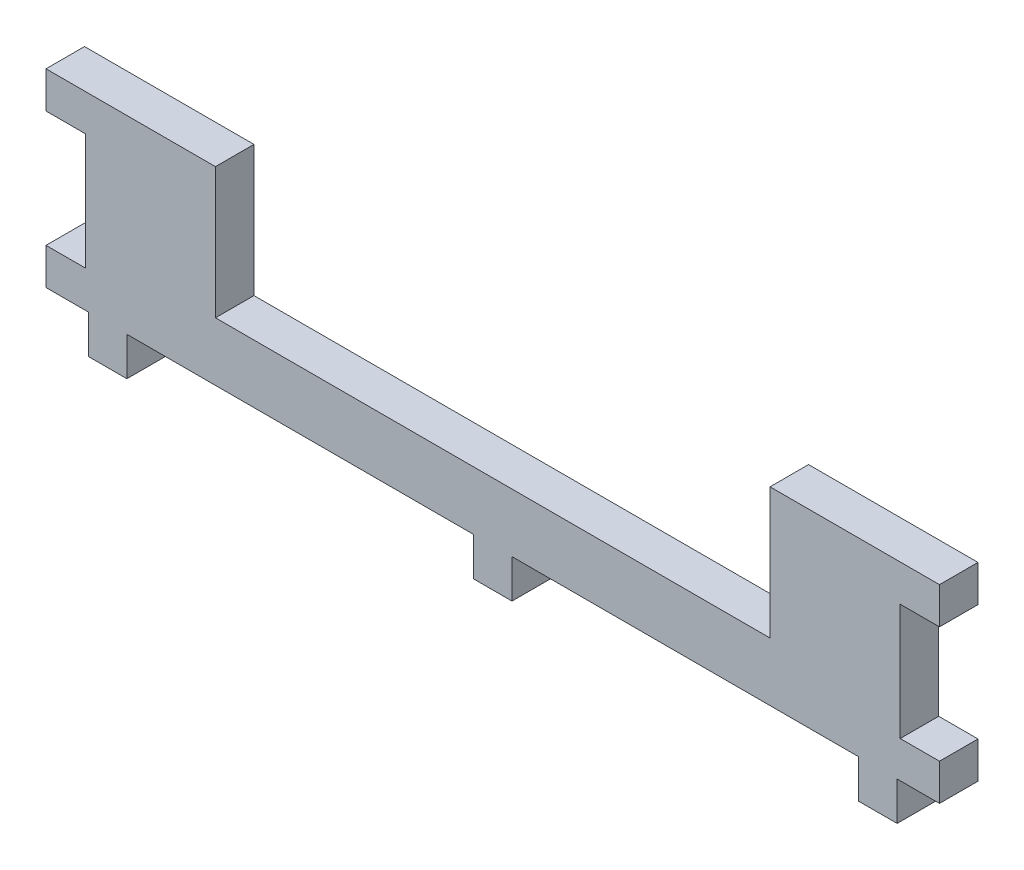
ISO-10303-21;
HEADER;
FILE_DESCRIPTION(('STEP AP214'),'2;1');
FILE_NAME('part.step','',(''),(''),'','','');
FILE_SCHEMA(('AUTOMOTIVE_DESIGN { 1 0 10303 214 1 1 1 1 }'));
ENDSEC;
DATA;
#1=APPLICATION_CONTEXT('core data for automotive mechanical design processes');
#2=APPLICATION_PROTOCOL_DEFINITION('international standard','automotive_design',2000,#1);
#3=PRODUCT_CONTEXT('',#1,'mechanical');
#4=PRODUCT('Part','Part','',(#3));
#5=PRODUCT_RELATED_PRODUCT_CATEGORY('part','',(#4));
#6=PRODUCT_DEFINITION_FORMATION('','',#4);
#7=PRODUCT_DEFINITION_CONTEXT('part definition',#1,'design');
#8=PRODUCT_DEFINITION('design','',#6,#7);
#9=PRODUCT_DEFINITION_SHAPE('','',#8);
#10=(LENGTH_UNIT() NAMED_UNIT(*) SI_UNIT(.MILLI.,.METRE.));
#11=(NAMED_UNIT(*) PLANE_ANGLE_UNIT() SI_UNIT($,.RADIAN.));
#12=(NAMED_UNIT(*) SI_UNIT($,.STERADIAN.) SOLID_ANGLE_UNIT());
#13=UNCERTAINTY_MEASURE_WITH_UNIT(LENGTH_MEASURE(1.E-05),#10,'distance_accuracy_value','');
#14=(GEOMETRIC_REPRESENTATION_CONTEXT(3) GLOBAL_UNCERTAINTY_ASSIGNED_CONTEXT((#13)) GLOBAL_UNIT_ASSIGNED_CONTEXT((#10,
#11,#12)) REPRESENTATION_CONTEXT('',''));
#15=CARTESIAN_POINT('',(0.,0.,0.));
#16=DIRECTION('',(0.,0.,1.));
#17=DIRECTION('',(1.,0.,0.));
#18=AXIS2_PLACEMENT_3D('',#15,#16,#17);
#19=CARTESIAN_POINT('',(58.,-6.15,5.));
#20=DIRECTION('',(-1.,0.,0.));
#21=DIRECTION('',(0.,0.,1.));
#22=AXIS2_PLACEMENT_3D('',#19,#20,#21);
#23=PLANE('',#22);
#24=DIRECTION('',(0.,0.,1.));
#25=VECTOR('',#24,1.);
#26=CARTESIAN_POINT('',(58.,-1.4,0.));
#27=LINE('',#26,#25);
#28=CARTESIAN_POINT('',(58.,-1.4,0.));
#29=VERTEX_POINT('',#28);
#30=CARTESIAN_POINT('',(58.,-1.4,5.));
#31=VERTEX_POINT('',#30);
#32=EDGE_CURVE('E238',#29,#31,#27,.T.);
#33=ORIENTED_EDGE('',*,*,#32,.T.);
#34=DIRECTION('',(0.,1.,0.));
#35=VECTOR('',#34,1.);
#36=CARTESIAN_POINT('',(58.,-6.15,5.));
#37=LINE('',#36,#35);
#38=CARTESIAN_POINT('',(58.,-6.15,5.));
#39=VERTEX_POINT('',#38);
#40=EDGE_CURVE('E401',#39,#31,#37,.T.);
#41=ORIENTED_EDGE('',*,*,#40,.F.);
#42=DIRECTION('',(0.,0.,-1.));
#43=VECTOR('',#42,1.);
#44=CARTESIAN_POINT('',(58.,-6.15,5.));
#45=LINE('',#44,#43);
#46=CARTESIAN_POINT('',(58.,-6.15,0.));
#47=VERTEX_POINT('',#46);
#48=EDGE_CURVE('E42',#39,#47,#45,.T.);
#49=ORIENTED_EDGE('',*,*,#48,.T.);
#50=DIRECTION('',(0.,1.,0.));
#51=VECTOR('',#50,1.);
#52=CARTESIAN_POINT('',(58.,-6.15,0.));
#53=LINE('',#52,#51);
#54=EDGE_CURVE('E436',#47,#29,#53,.T.);
#55=ORIENTED_EDGE('',*,*,#54,.T.);
#56=EDGE_LOOP('',(#33,#41,#49,#55));
#57=FACE_BOUND('',#56,.T.);
#58=ADVANCED_FACE('F33',(#57),#23,.F.);
#59=DIRECTION('',(0.,0.,-1.));
#60=VECTOR('',#59,1.);
#61=CARTESIAN_POINT('',(58.,13.7,0.));
#62=LINE('',#61,#60);
#63=CARTESIAN_POINT('',(58.,13.7,5.));
#64=VERTEX_POINT('',#63);
#65=CARTESIAN_POINT('',(58.,13.7,0.));
#66=VERTEX_POINT('',#65);
#67=EDGE_CURVE('E481',#64,#66,#62,.T.);
#68=ORIENTED_EDGE('',*,*,#67,.T.);
#69=CARTESIAN_POINT('',(58.,18.45,0.));
#70=VERTEX_POINT('',#69);
#71=EDGE_CURVE('E243',#66,#70,#53,.T.);
#72=ORIENTED_EDGE('',*,*,#71,.T.);
#73=DIRECTION('',(0.,0.,-1.));
#74=VECTOR('',#73,1.);
#75=CARTESIAN_POINT('',(58.,18.45,5.));
#76=LINE('',#75,#74);
#77=CARTESIAN_POINT('',(58.,18.45,5.));
#78=VERTEX_POINT('',#77);
#79=EDGE_CURVE('E457',#78,#70,#76,.T.);
#80=ORIENTED_EDGE('',*,*,#79,.F.);
#81=EDGE_CURVE('E397',#64,#78,#37,.T.);
#82=ORIENTED_EDGE('',*,*,#81,.F.);
#83=EDGE_LOOP('',(#68,#72,#80,#82));
#84=FACE_BOUND('',#83,.T.);
#85=ADVANCED_FACE('F480',(#84),#23,.F.);
#86=CARTESIAN_POINT('',(0.,0.,5.));
#87=DIRECTION('',(0.,0.,-1.));
#88=DIRECTION('',(-1.,0.,0.));
#89=AXIS2_PLACEMENT_3D('',#86,#87,#88);
#90=PLANE('',#89);
#91=DIRECTION('',(1.,0.,0.));
#92=VECTOR('',#91,1.);
#93=CARTESIAN_POINT('',(52.9,-1.4,5.));
#94=LINE('',#93,#92);
#95=CARTESIAN_POINT('',(52.9,-1.4,5.));
#96=VERTEX_POINT('',#95);
#97=EDGE_CURVE('E245',#96,#31,#94,.T.);
#98=ORIENTED_EDGE('',*,*,#97,.F.);
#99=DIRECTION('',(0.,1.,0.));
#100=VECTOR('',#99,1.);
#101=CARTESIAN_POINT('',(52.9,13.7,5.));
#102=LINE('',#101,#100);
#103=CARTESIAN_POINT('',(52.9,13.7,5.));
#104=VERTEX_POINT('',#103);
#105=EDGE_CURVE('E231',#96,#104,#102,.T.);
#106=ORIENTED_EDGE('',*,*,#105,.T.);
#107=DIRECTION('',(1.,0.,0.));
#108=VECTOR('',#107,1.);
#109=CARTESIAN_POINT('',(52.9,13.7,5.));
#110=LINE('',#109,#108);
#111=EDGE_CURVE('E227',#104,#64,#110,.T.);
#112=ORIENTED_EDGE('',*,*,#111,.T.);
#113=ORIENTED_EDGE('',*,*,#81,.T.);
#114=DIRECTION('',(1.,0.,0.));
#115=VECTOR('',#114,1.);
#116=CARTESIAN_POINT('',(-58.,18.45,5.));
#117=LINE('',#116,#115);
#118=CARTESIAN_POINT('',(36.,18.45,5.));
#119=VERTEX_POINT('',#118);
#120=EDGE_CURVE('E467',#119,#78,#117,.T.);
#121=ORIENTED_EDGE('',*,*,#120,.F.);
#122=DIRECTION('',(0.,1.,0.));
#123=VECTOR('',#122,1.);
#124=CARTESIAN_POINT('',(36.,1.45,5.));
#125=LINE('',#124,#123);
#126=CARTESIAN_POINT('',(36.,1.45,5.));
#127=VERTEX_POINT('',#126);
#128=EDGE_CURVE('E322',#127,#119,#125,.T.);
#129=ORIENTED_EDGE('',*,*,#128,.F.);
#130=DIRECTION('',(1.,0.,0.));
#131=VECTOR('',#130,1.);
#132=CARTESIAN_POINT('',(-36.,1.45,5.));
#133=LINE('',#132,#131);
#134=CARTESIAN_POINT('',(-36.,1.45,5.));
#135=VERTEX_POINT('',#134);
#136=EDGE_CURVE('E303',#135,#127,#133,.T.);
#137=ORIENTED_EDGE('',*,*,#136,.F.);
#138=DIRECTION('',(0.,1.,0.));
#139=VECTOR('',#138,1.);
#140=CARTESIAN_POINT('',(-36.,1.45,5.));
#141=LINE('',#140,#139);
#142=CARTESIAN_POINT('',(-36.,18.45,5.));
#143=VERTEX_POINT('',#142);
#144=EDGE_CURVE('E313',#135,#143,#141,.T.);
#145=ORIENTED_EDGE('',*,*,#144,.T.);
#146=CARTESIAN_POINT('',(-58.,18.45,5.));
#147=VERTEX_POINT('',#146);
#148=EDGE_CURVE('E462',#147,#143,#117,.T.);
#149=ORIENTED_EDGE('',*,*,#148,.F.);
#150=DIRECTION('',(0.,-1.,0.));
#151=VECTOR('',#150,1.);
#152=CARTESIAN_POINT('',(-58.,-6.15,5.));
#153=LINE('',#152,#151);
#154=CARTESIAN_POINT('',(-58.,13.7,5.));
#155=VERTEX_POINT('',#154);
#156=EDGE_CURVE('E426',#147,#155,#153,.T.);
#157=ORIENTED_EDGE('',*,*,#156,.T.);
#158=DIRECTION('',(-1.,0.,0.));
#159=VECTOR('',#158,1.);
#160=CARTESIAN_POINT('',(-52.9,13.7,5.));
#161=LINE('',#160,#159);
#162=CARTESIAN_POINT('',(-52.9,13.7,5.));
#163=VERTEX_POINT('',#162);
#164=EDGE_CURVE('E267',#163,#155,#161,.T.);
#165=ORIENTED_EDGE('',*,*,#164,.F.);
#166=DIRECTION('',(0.,1.,0.));
#167=VECTOR('',#166,1.);
#168=CARTESIAN_POINT('',(-52.9,13.7,5.));
#169=LINE('',#168,#167);
#170=CARTESIAN_POINT('',(-52.9,-1.4,5.));
#171=VERTEX_POINT('',#170);
#172=EDGE_CURVE('E256',#171,#163,#169,.T.);
#173=ORIENTED_EDGE('',*,*,#172,.F.);
#174=DIRECTION('',(-1.,0.,0.));
#175=VECTOR('',#174,1.);
#176=CARTESIAN_POINT('',(-52.9,-1.4,5.));
#177=LINE('',#176,#175);
#178=CARTESIAN_POINT('',(-58.,-1.4,5.));
#179=VERTEX_POINT('',#178);
#180=EDGE_CURVE('E269',#171,#179,#177,.T.);
#181=ORIENTED_EDGE('',*,*,#180,.T.);
#182=CARTESIAN_POINT('',(-58.,-6.15,5.));
#183=VERTEX_POINT('',#182);
#184=EDGE_CURVE('E430',#179,#183,#153,.T.);
#185=ORIENTED_EDGE('',*,*,#184,.T.);
#186=DIRECTION('',(1.,0.,0.));
#187=VECTOR('',#186,1.);
#188=CARTESIAN_POINT('',(-58.,-6.15,5.));
#189=LINE('',#188,#187);
#190=CARTESIAN_POINT('',(-52.5,-6.15,5.));
#191=VERTEX_POINT('',#190);
#192=EDGE_CURVE('E424',#183,#191,#189,.T.);
#193=ORIENTED_EDGE('',*,*,#192,.T.);
#194=DIRECTION('',(0.,1.,0.));
#195=VECTOR('',#194,1.);
#196=CARTESIAN_POINT('',(-52.5,-11.15,5.));
#197=LINE('',#196,#195);
#198=CARTESIAN_POINT('',(-52.5,-11.15,5.));
#199=VERTEX_POINT('',#198);
#200=EDGE_CURVE('E363',#199,#191,#197,.T.);
#201=ORIENTED_EDGE('',*,*,#200,.F.);
#202=DIRECTION('',(-1.,0.,0.));
#203=VECTOR('',#202,1.);
#204=CARTESIAN_POINT('',(-52.5,-11.15,5.));
#205=LINE('',#204,#203);
#206=CARTESIAN_POINT('',(-47.5,-11.15,5.));
#207=VERTEX_POINT('',#206);
#208=EDGE_CURVE('E361',#207,#199,#205,.T.);
#209=ORIENTED_EDGE('',*,*,#208,.F.);
#210=DIRECTION('',(0.,1.,0.));
#211=VECTOR('',#210,1.);
#212=CARTESIAN_POINT('',(-47.5,-11.15,5.));
#213=LINE('',#212,#211);
#214=CARTESIAN_POINT('',(-47.5,-6.15,5.));
#215=VERTEX_POINT('',#214);
#216=EDGE_CURVE('E376',#207,#215,#213,.T.);
#217=ORIENTED_EDGE('',*,*,#216,.T.);
#218=CARTESIAN_POINT('',(-2.50000000000002,-6.15,5.));
#219=VERTEX_POINT('',#218);
#220=EDGE_CURVE('E422',#215,#219,#189,.T.);
#221=ORIENTED_EDGE('',*,*,#220,.T.);
#222=DIRECTION('',(0.,1.,0.));
#223=VECTOR('',#222,1.);
#224=CARTESIAN_POINT('',(-2.5,-11.15,5.));
#225=LINE('',#224,#223);
#226=CARTESIAN_POINT('',(-2.5,-11.15,5.));
#227=VERTEX_POINT('',#226);
#228=EDGE_CURVE('E283',#227,#219,#225,.T.);
#229=ORIENTED_EDGE('',*,*,#228,.F.);
#230=DIRECTION('',(-1.,0.,0.));
#231=VECTOR('',#230,1.);
#232=CARTESIAN_POINT('',(-2.5,-11.15,5.));
#233=LINE('',#232,#231);
#234=CARTESIAN_POINT('',(2.5,-11.15,5.));
#235=VERTEX_POINT('',#234);
#236=EDGE_CURVE('E281',#235,#227,#233,.T.);
#237=ORIENTED_EDGE('',*,*,#236,.F.);
#238=DIRECTION('',(0.,1.,0.));
#239=VECTOR('',#238,1.);
#240=CARTESIAN_POINT('',(2.5,-11.15,5.));
#241=LINE('',#240,#239);
#242=CARTESIAN_POINT('',(2.49999999999998,-6.15,5.));
#243=VERTEX_POINT('',#242);
#244=EDGE_CURVE('E290',#235,#243,#241,.T.);
#245=ORIENTED_EDGE('',*,*,#244,.T.);
#246=CARTESIAN_POINT('',(47.5,-6.15,5.));
#247=VERTEX_POINT('',#246);
#248=EDGE_CURVE('E36',#243,#247,#189,.T.);
#249=ORIENTED_EDGE('',*,*,#248,.T.);
#250=DIRECTION('',(0.,1.,0.));
#251=VECTOR('',#250,1.);
#252=CARTESIAN_POINT('',(47.5,-11.15,5.));
#253=LINE('',#252,#251);
#254=CARTESIAN_POINT('',(47.5,-11.15,5.));
#255=VERTEX_POINT('',#254);
#256=EDGE_CURVE('E336',#255,#247,#253,.T.);
#257=ORIENTED_EDGE('',*,*,#256,.F.);
#258=DIRECTION('',(-1.,0.,0.));
#259=VECTOR('',#258,1.);
#260=CARTESIAN_POINT('',(47.5,-11.15,5.));
#261=LINE('',#260,#259);
#262=CARTESIAN_POINT('',(52.5,-11.15,5.));
#263=VERTEX_POINT('',#262);
#264=EDGE_CURVE('E334',#263,#255,#261,.T.);
#265=ORIENTED_EDGE('',*,*,#264,.F.);
#266=DIRECTION('',(0.,1.,0.));
#267=VECTOR('',#266,1.);
#268=CARTESIAN_POINT('',(52.5,-11.15,5.));
#269=LINE('',#268,#267);
#270=CARTESIAN_POINT('',(52.5,-6.15,5.));
#271=VERTEX_POINT('',#270);
#272=EDGE_CURVE('E343',#263,#271,#269,.T.);
#273=ORIENTED_EDGE('',*,*,#272,.T.);
#274=EDGE_CURVE('E384',#271,#39,#189,.T.);
#275=ORIENTED_EDGE('',*,*,#274,.T.);
#276=ORIENTED_EDGE('',*,*,#40,.T.);
#277=EDGE_LOOP('',(#98,#106,#112,#113,#121,#129,#137,#145,#149,#157,#165,#173,#181,#185,#193,
#201,#209,#217,#221,#229,#237,#245,#249,#257,#265,#273,#275,#276));
#278=FACE_BOUND('',#277,.T.);
#279=ADVANCED_FACE('F419',(#278),#90,.F.);
#280=CARTESIAN_POINT('',(0.,0.,0.));
#281=DIRECTION('',(0.,0.,-1.));
#282=DIRECTION('',(-1.,0.,0.));
#283=AXIS2_PLACEMENT_3D('',#280,#281,#282);
#284=PLANE('',#283);
#285=DIRECTION('',(0.,-1.,0.));
#286=VECTOR('',#285,1.);
#287=CARTESIAN_POINT('',(52.9,13.7,0.));
#288=LINE('',#287,#286);
#289=CARTESIAN_POINT('',(52.9,13.7,0.));
#290=VERTEX_POINT('',#289);
#291=CARTESIAN_POINT('',(52.9,-1.4,0.));
#292=VERTEX_POINT('',#291);
#293=EDGE_CURVE('E232',#290,#292,#288,.T.);
#294=ORIENTED_EDGE('',*,*,#293,.T.);
#295=DIRECTION('',(1.,0.,0.));
#296=VECTOR('',#295,1.);
#297=CARTESIAN_POINT('',(52.9,-1.4,0.));
#298=LINE('',#297,#296);
#299=EDGE_CURVE('E50',#292,#29,#298,.T.);
#300=ORIENTED_EDGE('',*,*,#299,.T.);
#301=ORIENTED_EDGE('',*,*,#54,.F.);
#302=DIRECTION('',(1.,0.,0.));
#303=VECTOR('',#302,1.);
#304=CARTESIAN_POINT('',(-58.,-6.15,0.));
#305=LINE('',#304,#303);
#306=CARTESIAN_POINT('',(52.5,-6.15,0.));
#307=VERTEX_POINT('',#306);
#308=EDGE_CURVE('E379',#307,#47,#305,.T.);
#309=ORIENTED_EDGE('',*,*,#308,.F.);
#310=DIRECTION('',(0.,1.,0.));
#311=VECTOR('',#310,1.);
#312=CARTESIAN_POINT('',(52.5,-11.15,0.));
#313=LINE('',#312,#311);
#314=CARTESIAN_POINT('',(52.5,-11.15,0.));
#315=VERTEX_POINT('',#314);
#316=EDGE_CURVE('E346',#315,#307,#313,.T.);
#317=ORIENTED_EDGE('',*,*,#316,.F.);
#318=DIRECTION('',(1.,0.,0.));
#319=VECTOR('',#318,1.);
#320=CARTESIAN_POINT('',(47.5,-11.15,0.));
#321=LINE('',#320,#319);
#322=CARTESIAN_POINT('',(47.5,-11.15,0.));
#323=VERTEX_POINT('',#322);
#324=EDGE_CURVE('E329',#323,#315,#321,.T.);
#325=ORIENTED_EDGE('',*,*,#324,.F.);
#326=DIRECTION('',(0.,1.,0.));
#327=VECTOR('',#326,1.);
#328=CARTESIAN_POINT('',(47.5,-11.15,0.));
#329=LINE('',#328,#327);
#330=CARTESIAN_POINT('',(47.5,-6.15,0.));
#331=VERTEX_POINT('',#330);
#332=EDGE_CURVE('E349',#323,#331,#329,.T.);
#333=ORIENTED_EDGE('',*,*,#332,.T.);
#334=CARTESIAN_POINT('',(2.5,-6.15,0.));
#335=VERTEX_POINT('',#334);
#336=EDGE_CURVE('E382',#335,#331,#305,.T.);
#337=ORIENTED_EDGE('',*,*,#336,.F.);
#338=DIRECTION('',(0.,1.,0.));
#339=VECTOR('',#338,1.);
#340=CARTESIAN_POINT('',(2.5,-11.15,0.));
#341=LINE('',#340,#339);
#342=CARTESIAN_POINT('',(2.5,-11.15,0.));
#343=VERTEX_POINT('',#342);
#344=EDGE_CURVE('E293',#343,#335,#341,.T.);
#345=ORIENTED_EDGE('',*,*,#344,.F.);
#346=DIRECTION('',(1.,0.,0.));
#347=VECTOR('',#346,1.);
#348=CARTESIAN_POINT('',(-2.5,-11.15,0.));
#349=LINE('',#348,#347);
#350=CARTESIAN_POINT('',(-2.5,-11.15,0.));
#351=VERTEX_POINT('',#350);
#352=EDGE_CURVE('E276',#351,#343,#349,.T.);
#353=ORIENTED_EDGE('',*,*,#352,.F.);
#354=DIRECTION('',(0.,1.,0.));
#355=VECTOR('',#354,1.);
#356=CARTESIAN_POINT('',(-2.5,-11.15,0.));
#357=LINE('',#356,#355);
#358=CARTESIAN_POINT('',(-2.50000000000002,-6.15,0.));
#359=VERTEX_POINT('',#358);
#360=EDGE_CURVE('E296',#351,#359,#357,.T.);
#361=ORIENTED_EDGE('',*,*,#360,.T.);
#362=CARTESIAN_POINT('',(-47.5,-6.15,0.));
#363=VERTEX_POINT('',#362);
#364=EDGE_CURVE('E392',#363,#359,#305,.T.);
#365=ORIENTED_EDGE('',*,*,#364,.F.);
#366=DIRECTION('',(0.,1.,0.));
#367=VECTOR('',#366,1.);
#368=CARTESIAN_POINT('',(-47.5,-11.15,0.));
#369=LINE('',#368,#367);
#370=CARTESIAN_POINT('',(-47.5,-11.15,0.));
#371=VERTEX_POINT('',#370);
#372=EDGE_CURVE('E546',#371,#363,#369,.T.);
#373=ORIENTED_EDGE('',*,*,#372,.F.);
#374=DIRECTION('',(1.,0.,0.));
#375=VECTOR('',#374,1.);
#376=CARTESIAN_POINT('',(-52.5,-11.15,0.));
#377=LINE('',#376,#375);
#378=CARTESIAN_POINT('',(-52.5,-11.15,0.));
#379=VERTEX_POINT('',#378);
#380=EDGE_CURVE('E356',#379,#371,#377,.T.);
#381=ORIENTED_EDGE('',*,*,#380,.F.);
#382=DIRECTION('',(0.,1.,0.));
#383=VECTOR('',#382,1.);
#384=CARTESIAN_POINT('',(-52.5,-11.15,0.));
#385=LINE('',#384,#383);
#386=CARTESIAN_POINT('',(-52.5,-6.15,0.));
#387=VERTEX_POINT('',#386);
#388=EDGE_CURVE('E545',#379,#387,#385,.T.);
#389=ORIENTED_EDGE('',*,*,#388,.T.);
#390=CARTESIAN_POINT('',(-58.,-6.15,0.));
#391=VERTEX_POINT('',#390);
#392=EDGE_CURVE('E396',#391,#387,#305,.T.);
#393=ORIENTED_EDGE('',*,*,#392,.F.);
#394=DIRECTION('',(0.,-1.,0.));
#395=VECTOR('',#394,1.);
#396=CARTESIAN_POINT('',(-58.,-6.15,0.));
#397=LINE('',#396,#395);
#398=CARTESIAN_POINT('',(-58.,-1.4,0.));
#399=VERTEX_POINT('',#398);
#400=EDGE_CURVE('E452',#399,#391,#397,.T.);
#401=ORIENTED_EDGE('',*,*,#400,.F.);
#402=DIRECTION('',(-1.,0.,0.));
#403=VECTOR('',#402,1.);
#404=CARTESIAN_POINT('',(-52.9,-1.4,0.));
#405=LINE('',#404,#403);
#406=CARTESIAN_POINT('',(-52.9,-1.4,0.));
#407=VERTEX_POINT('',#406);
#408=EDGE_CURVE('E259',#407,#399,#405,.T.);
#409=ORIENTED_EDGE('',*,*,#408,.F.);
#410=DIRECTION('',(0.,-1.,0.));
#411=VECTOR('',#410,1.);
#412=CARTESIAN_POINT('',(-52.9,13.7,0.));
#413=LINE('',#412,#411);
#414=CARTESIAN_POINT('',(-52.9,13.7,0.));
#415=VERTEX_POINT('',#414);
#416=EDGE_CURVE('E250',#415,#407,#413,.T.);
#417=ORIENTED_EDGE('',*,*,#416,.F.);
#418=DIRECTION('',(-1.,0.,0.));
#419=VECTOR('',#418,1.);
#420=CARTESIAN_POINT('',(-52.9,13.7,0.));
#421=LINE('',#420,#419);
#422=CARTESIAN_POINT('',(-58.,13.7,0.));
#423=VERTEX_POINT('',#422);
#424=EDGE_CURVE('E263',#415,#423,#421,.T.);
#425=ORIENTED_EDGE('',*,*,#424,.T.);
#426=CARTESIAN_POINT('',(-58.,18.45,0.));
#427=VERTEX_POINT('',#426);
#428=EDGE_CURVE('E383',#427,#423,#397,.T.);
#429=ORIENTED_EDGE('',*,*,#428,.F.);
#430=DIRECTION('',(1.,0.,0.));
#431=VECTOR('',#430,1.);
#432=CARTESIAN_POINT('',(-58.,18.45,0.));
#433=LINE('',#432,#431);
#434=CARTESIAN_POINT('',(-36.,18.45,0.));
#435=VERTEX_POINT('',#434);
#436=EDGE_CURVE('E465',#427,#435,#433,.T.);
#437=ORIENTED_EDGE('',*,*,#436,.T.);
#438=DIRECTION('',(0.,1.,0.));
#439=VECTOR('',#438,1.);
#440=CARTESIAN_POINT('',(-36.,1.45,0.));
#441=LINE('',#440,#439);
#442=CARTESIAN_POINT('',(-36.,1.45,0.));
#443=VERTEX_POINT('',#442);
#444=EDGE_CURVE('E316',#443,#435,#441,.T.);
#445=ORIENTED_EDGE('',*,*,#444,.F.);
#446=DIRECTION('',(-1.,0.,0.));
#447=VECTOR('',#446,1.);
#448=CARTESIAN_POINT('',(-36.,1.45,0.));
#449=LINE('',#448,#447);
#450=CARTESIAN_POINT('',(36.,1.45,0.));
#451=VERTEX_POINT('',#450);
#452=EDGE_CURVE('E310',#451,#443,#449,.T.);
#453=ORIENTED_EDGE('',*,*,#452,.F.);
#454=DIRECTION('',(0.,1.,0.));
#455=VECTOR('',#454,1.);
#456=CARTESIAN_POINT('',(36.,1.45,0.));
#457=LINE('',#456,#455);
#458=CARTESIAN_POINT('',(36.,18.45,0.));
#459=VERTEX_POINT('',#458);
#460=EDGE_CURVE('E319',#451,#459,#457,.T.);
#461=ORIENTED_EDGE('',*,*,#460,.T.);
#462=EDGE_CURVE('E468',#459,#70,#433,.T.);
#463=ORIENTED_EDGE('',*,*,#462,.T.);
#464=ORIENTED_EDGE('',*,*,#71,.F.);
#465=DIRECTION('',(1.,0.,0.));
#466=VECTOR('',#465,1.);
#467=CARTESIAN_POINT('',(52.9,13.7,0.));
#468=LINE('',#467,#466);
#469=EDGE_CURVE('E224',#290,#66,#468,.T.);
#470=ORIENTED_EDGE('',*,*,#469,.F.);
#471=EDGE_LOOP('',(#294,#300,#301,#309,#317,#325,#333,#337,#345,#353,#361,#365,#373,#381,#389,
#393,#401,#409,#417,#425,#429,#437,#445,#453,#461,#463,#464,#470));
#472=FACE_BOUND('',#471,.T.);
#473=ADVANCED_FACE('F241',(#472),#284,.T.);
#474=CARTESIAN_POINT('',(-58.,-6.15,5.));
#475=DIRECTION('',(1.,0.,0.));
#476=DIRECTION('',(0.,0.,-1.));
#477=AXIS2_PLACEMENT_3D('',#474,#475,#476);
#478=PLANE('',#477);
#479=ORIENTED_EDGE('',*,*,#428,.T.);
#480=DIRECTION('',(0.,0.,-1.));
#481=VECTOR('',#480,1.);
#482=CARTESIAN_POINT('',(-58.,13.7,0.));
#483=LINE('',#482,#481);
#484=EDGE_CURVE('E253',#155,#423,#483,.T.);
#485=ORIENTED_EDGE('',*,*,#484,.F.);
#486=ORIENTED_EDGE('',*,*,#156,.F.);
#487=DIRECTION('',(0.,0.,-1.));
#488=VECTOR('',#487,1.);
#489=CARTESIAN_POINT('',(-58.,18.45,5.));
#490=LINE('',#489,#488);
#491=EDGE_CURVE('E453',#147,#427,#490,.T.);
#492=ORIENTED_EDGE('',*,*,#491,.T.);
#493=EDGE_LOOP('',(#479,#485,#486,#492));
#494=FACE_BOUND('',#493,.T.);
#495=ADVANCED_FACE('F510',(#494),#478,.F.);
#496=CARTESIAN_POINT('',(-58.,-6.15,5.));
#497=DIRECTION('',(0.,1.,0.));
#498=DIRECTION('',(0.,0.,1.));
#499=AXIS2_PLACEMENT_3D('',#496,#497,#498);
#500=PLANE('',#499);
#501=DIRECTION('',(0.,0.,-1.));
#502=VECTOR('',#501,1.);
#503=CARTESIAN_POINT('',(-2.5,-6.15,5.));
#504=LINE('',#503,#502);
#505=EDGE_CURVE('E266',#219,#359,#504,.T.);
#506=ORIENTED_EDGE('',*,*,#505,.F.);
#507=ORIENTED_EDGE('',*,*,#220,.F.);
#508=DIRECTION('',(0.,0.,1.));
#509=VECTOR('',#508,1.);
#510=CARTESIAN_POINT('',(-47.5,-6.15,5.));
#511=LINE('',#510,#509);
#512=EDGE_CURVE('E357',#363,#215,#511,.T.);
#513=ORIENTED_EDGE('',*,*,#512,.F.);
#514=ORIENTED_EDGE('',*,*,#364,.T.);
#515=EDGE_LOOP('',(#506,#507,#513,#514));
#516=FACE_BOUND('',#515,.T.);
#517=ADVANCED_FACE('F519',(#516),#500,.F.);
#518=DIRECTION('',(0.,0.,1.));
#519=VECTOR('',#518,1.);
#520=CARTESIAN_POINT('',(2.5,-6.15,5.));
#521=LINE('',#520,#519);
#522=EDGE_CURVE('E277',#335,#243,#521,.T.);
#523=ORIENTED_EDGE('',*,*,#522,.F.);
#524=ORIENTED_EDGE('',*,*,#336,.T.);
#525=DIRECTION('',(0.,0.,-1.));
#526=VECTOR('',#525,1.);
#527=CARTESIAN_POINT('',(47.5,-6.15,5.));
#528=LINE('',#527,#526);
#529=EDGE_CURVE('E318',#247,#331,#528,.T.);
#530=ORIENTED_EDGE('',*,*,#529,.F.);
#531=ORIENTED_EDGE('',*,*,#248,.F.);
#532=EDGE_LOOP('',(#523,#524,#530,#531));
#533=FACE_BOUND('',#532,.T.);
#534=ADVANCED_FACE('F408',(#533),#500,.F.);
#535=CARTESIAN_POINT('',(-58.,18.45,5.));
#536=DIRECTION('',(0.,-1.,0.));
#537=DIRECTION('',(0.,0.,1.));
#538=AXIS2_PLACEMENT_3D('',#535,#536,#537);
#539=PLANE('',#538);
#540=ORIENTED_EDGE('',*,*,#148,.T.);
#541=DIRECTION('',(0.,0.,1.));
#542=VECTOR('',#541,1.);
#543=CARTESIAN_POINT('',(-36.,18.45,0.));
#544=LINE('',#543,#542);
#545=EDGE_CURVE('E299',#435,#143,#544,.T.);
#546=ORIENTED_EDGE('',*,*,#545,.F.);
#547=ORIENTED_EDGE('',*,*,#436,.F.);
#548=ORIENTED_EDGE('',*,*,#491,.F.);
#549=EDGE_LOOP('',(#540,#546,#547,#548));
#550=FACE_BOUND('',#549,.T.);
#551=ADVANCED_FACE('F528',(#550),#539,.F.);
#552=DIRECTION('',(0.,0.,1.));
#553=VECTOR('',#552,1.);
#554=CARTESIAN_POINT('',(52.5,-6.15,5.));
#555=LINE('',#554,#553);
#556=EDGE_CURVE('E330',#307,#271,#555,.T.);
#557=ORIENTED_EDGE('',*,*,#556,.F.);
#558=ORIENTED_EDGE('',*,*,#308,.T.);
#559=ORIENTED_EDGE('',*,*,#48,.F.);
#560=ORIENTED_EDGE('',*,*,#274,.F.);
#561=EDGE_LOOP('',(#557,#558,#559,#560));
#562=FACE_BOUND('',#561,.T.);
#563=ADVANCED_FACE('F518',(#562),#500,.F.);
#564=DIRECTION('',(0.,0.,-1.));
#565=VECTOR('',#564,1.);
#566=CARTESIAN_POINT('',(-52.5,-6.15,5.));
#567=LINE('',#566,#565);
#568=EDGE_CURVE('E352',#191,#387,#567,.T.);
#569=ORIENTED_EDGE('',*,*,#568,.F.);
#570=ORIENTED_EDGE('',*,*,#192,.F.);
#571=DIRECTION('',(0.,0.,-1.));
#572=VECTOR('',#571,1.);
#573=CARTESIAN_POINT('',(-58.,-6.15,5.));
#574=LINE('',#573,#572);
#575=EDGE_CURVE('E11',#183,#391,#574,.T.);
#576=ORIENTED_EDGE('',*,*,#575,.T.);
#577=ORIENTED_EDGE('',*,*,#392,.T.);
#578=EDGE_LOOP('',(#569,#570,#576,#577));
#579=FACE_BOUND('',#578,.T.);
#580=ADVANCED_FACE('F515',(#579),#500,.F.);
#581=ORIENTED_EDGE('',*,*,#184,.F.);
#582=DIRECTION('',(0.,0.,1.));
#583=VECTOR('',#582,1.);
#584=CARTESIAN_POINT('',(-58.,-1.4,0.));
#585=LINE('',#584,#583);
#586=EDGE_CURVE('E260',#399,#179,#585,.T.);
#587=ORIENTED_EDGE('',*,*,#586,.F.);
#588=ORIENTED_EDGE('',*,*,#400,.T.);
#589=ORIENTED_EDGE('',*,*,#575,.F.);
#590=EDGE_LOOP('',(#581,#587,#588,#589));
#591=FACE_BOUND('',#590,.T.);
#592=ADVANCED_FACE('F517',(#591),#478,.F.);
#593=ORIENTED_EDGE('',*,*,#462,.F.);
#594=DIRECTION('',(0.,0.,-1.));
#595=VECTOR('',#594,1.);
#596=CARTESIAN_POINT('',(36.,18.45,0.));
#597=LINE('',#596,#595);
#598=EDGE_CURVE('E304',#119,#459,#597,.T.);
#599=ORIENTED_EDGE('',*,*,#598,.F.);
#600=ORIENTED_EDGE('',*,*,#120,.T.);
#601=ORIENTED_EDGE('',*,*,#79,.T.);
#602=EDGE_LOOP('',(#593,#599,#600,#601));
#603=FACE_BOUND('',#602,.T.);
#604=ADVANCED_FACE('F477',(#603),#539,.F.);
#605=CARTESIAN_POINT('',(-52.5,-11.15,5.));
#606=DIRECTION('',(1.,0.,0.));
#607=DIRECTION('',(0.,0.,-1.));
#608=AXIS2_PLACEMENT_3D('',#605,#606,#607);
#609=PLANE('',#608);
#610=ORIENTED_EDGE('',*,*,#568,.T.);
#611=ORIENTED_EDGE('',*,*,#388,.F.);
#612=DIRECTION('',(0.,0.,-1.));
#613=VECTOR('',#612,1.);
#614=CARTESIAN_POINT('',(-52.5,-11.15,5.));
#615=LINE('',#614,#613);
#616=EDGE_CURVE('E353',#199,#379,#615,.T.);
#617=ORIENTED_EDGE('',*,*,#616,.F.);
#618=ORIENTED_EDGE('',*,*,#200,.T.);
#619=EDGE_LOOP('',(#610,#611,#617,#618));
#620=FACE_BOUND('',#619,.T.);
#621=ADVANCED_FACE('F527',(#620),#609,.F.);
#622=CARTESIAN_POINT('',(-47.5,-11.15,5.));
#623=DIRECTION('',(-1.,0.,0.));
#624=DIRECTION('',(0.,0.,1.));
#625=AXIS2_PLACEMENT_3D('',#622,#623,#624);
#626=PLANE('',#625);
#627=ORIENTED_EDGE('',*,*,#512,.T.);
#628=ORIENTED_EDGE('',*,*,#216,.F.);
#629=DIRECTION('',(0.,0.,1.));
#630=VECTOR('',#629,1.);
#631=CARTESIAN_POINT('',(-47.5,-11.15,5.));
#632=LINE('',#631,#630);
#633=EDGE_CURVE('E359',#371,#207,#632,.T.);
#634=ORIENTED_EDGE('',*,*,#633,.F.);
#635=ORIENTED_EDGE('',*,*,#372,.T.);
#636=EDGE_LOOP('',(#627,#628,#634,#635));
#637=FACE_BOUND('',#636,.T.);
#638=ADVANCED_FACE('F559',(#637),#626,.F.);
#639=CARTESIAN_POINT('',(0.,-11.15,0.));
#640=DIRECTION('',(0.,-1.,0.));
#641=DIRECTION('',(0.,0.,-1.));
#642=AXIS2_PLACEMENT_3D('',#639,#640,#641);
#643=PLANE('',#642);
#644=ORIENTED_EDGE('',*,*,#616,.T.);
#645=ORIENTED_EDGE('',*,*,#380,.T.);
#646=ORIENTED_EDGE('',*,*,#633,.T.);
#647=ORIENTED_EDGE('',*,*,#208,.T.);
#648=EDGE_LOOP('',(#644,#645,#646,#647));
#649=FACE_BOUND('',#648,.T.);
#650=ADVANCED_FACE('F566',(#649),#643,.T.);
#651=CARTESIAN_POINT('',(47.5,-11.15,5.));
#652=DIRECTION('',(1.,0.,0.));
#653=DIRECTION('',(0.,0.,-1.));
#654=AXIS2_PLACEMENT_3D('',#651,#652,#653);
#655=PLANE('',#654);
#656=ORIENTED_EDGE('',*,*,#529,.T.);
#657=ORIENTED_EDGE('',*,*,#332,.F.);
#658=DIRECTION('',(0.,0.,-1.));
#659=VECTOR('',#658,1.);
#660=CARTESIAN_POINT('',(47.5,-11.15,5.));
#661=LINE('',#660,#659);
#662=EDGE_CURVE('E326',#255,#323,#661,.T.);
#663=ORIENTED_EDGE('',*,*,#662,.F.);
#664=ORIENTED_EDGE('',*,*,#256,.T.);
#665=EDGE_LOOP('',(#656,#657,#663,#664));
#666=FACE_BOUND('',#665,.T.);
#667=ADVANCED_FACE('F414',(#666),#655,.F.);
#668=CARTESIAN_POINT('',(52.5,-11.15,5.));
#669=DIRECTION('',(-1.,0.,0.));
#670=DIRECTION('',(0.,0.,1.));
#671=AXIS2_PLACEMENT_3D('',#668,#669,#670);
#672=PLANE('',#671);
#673=ORIENTED_EDGE('',*,*,#556,.T.);
#674=ORIENTED_EDGE('',*,*,#272,.F.);
#675=DIRECTION('',(0.,0.,1.));
#676=VECTOR('',#675,1.);
#677=CARTESIAN_POINT('',(52.5,-11.15,5.));
#678=LINE('',#677,#676);
#679=EDGE_CURVE('E332',#315,#263,#678,.T.);
#680=ORIENTED_EDGE('',*,*,#679,.F.);
#681=ORIENTED_EDGE('',*,*,#316,.T.);
#682=EDGE_LOOP('',(#673,#674,#680,#681));
#683=FACE_BOUND('',#682,.T.);
#684=ADVANCED_FACE('F597',(#683),#672,.F.);
#685=CARTESIAN_POINT('',(0.,-11.15,0.));
#686=DIRECTION('',(0.,-1.,0.));
#687=DIRECTION('',(0.,0.,-1.));
#688=AXIS2_PLACEMENT_3D('',#685,#686,#687);
#689=PLANE('',#688);
#690=ORIENTED_EDGE('',*,*,#662,.T.);
#691=ORIENTED_EDGE('',*,*,#324,.T.);
#692=ORIENTED_EDGE('',*,*,#679,.T.);
#693=ORIENTED_EDGE('',*,*,#264,.T.);
#694=EDGE_LOOP('',(#690,#691,#692,#693));
#695=FACE_BOUND('',#694,.T.);
#696=ADVANCED_FACE('F594',(#695),#689,.T.);
#697=CARTESIAN_POINT('',(-36.,1.45,0.));
#698=DIRECTION('',(-1.,0.,0.));
#699=DIRECTION('',(0.,0.,1.));
#700=AXIS2_PLACEMENT_3D('',#697,#698,#699);
#701=PLANE('',#700);
#702=ORIENTED_EDGE('',*,*,#545,.T.);
#703=ORIENTED_EDGE('',*,*,#144,.F.);
#704=DIRECTION('',(0.,0.,1.));
#705=VECTOR('',#704,1.);
#706=CARTESIAN_POINT('',(-36.,1.45,0.));
#707=LINE('',#706,#705);
#708=EDGE_CURVE('E300',#443,#135,#707,.T.);
#709=ORIENTED_EDGE('',*,*,#708,.F.);
#710=ORIENTED_EDGE('',*,*,#444,.T.);
#711=EDGE_LOOP('',(#702,#703,#709,#710));
#712=FACE_BOUND('',#711,.T.);
#713=ADVANCED_FACE('F539',(#712),#701,.F.);
#714=CARTESIAN_POINT('',(36.,1.45,0.));
#715=DIRECTION('',(1.,0.,0.));
#716=DIRECTION('',(0.,0.,-1.));
#717=AXIS2_PLACEMENT_3D('',#714,#715,#716);
#718=PLANE('',#717);
#719=ORIENTED_EDGE('',*,*,#598,.T.);
#720=ORIENTED_EDGE('',*,*,#460,.F.);
#721=DIRECTION('',(0.,0.,-1.));
#722=VECTOR('',#721,1.);
#723=CARTESIAN_POINT('',(36.,1.45,0.));
#724=LINE('',#723,#722);
#725=EDGE_CURVE('E307',#127,#451,#724,.T.);
#726=ORIENTED_EDGE('',*,*,#725,.F.);
#727=ORIENTED_EDGE('',*,*,#128,.T.);
#728=EDGE_LOOP('',(#719,#720,#726,#727));
#729=FACE_BOUND('',#728,.T.);
#730=ADVANCED_FACE('F589',(#729),#718,.F.);
#731=CARTESIAN_POINT('',(0.,1.45,0.));
#732=DIRECTION('',(0.,1.,0.));
#733=DIRECTION('',(0.,0.,1.));
#734=AXIS2_PLACEMENT_3D('',#731,#732,#733);
#735=PLANE('',#734);
#736=ORIENTED_EDGE('',*,*,#708,.T.);
#737=ORIENTED_EDGE('',*,*,#136,.T.);
#738=ORIENTED_EDGE('',*,*,#725,.T.);
#739=ORIENTED_EDGE('',*,*,#452,.T.);
#740=EDGE_LOOP('',(#736,#737,#738,#739));
#741=FACE_BOUND('',#740,.T.);
#742=ADVANCED_FACE('F542',(#741),#735,.T.);
#743=CARTESIAN_POINT('',(-2.5,-11.15,5.));
#744=DIRECTION('',(1.,0.,0.));
#745=DIRECTION('',(0.,0.,-1.));
#746=AXIS2_PLACEMENT_3D('',#743,#744,#745);
#747=PLANE('',#746);
#748=ORIENTED_EDGE('',*,*,#505,.T.);
#749=ORIENTED_EDGE('',*,*,#360,.F.);
#750=DIRECTION('',(0.,0.,-1.));
#751=VECTOR('',#750,1.);
#752=CARTESIAN_POINT('',(-2.5,-11.15,5.));
#753=LINE('',#752,#751);
#754=EDGE_CURVE('E273',#227,#351,#753,.T.);
#755=ORIENTED_EDGE('',*,*,#754,.F.);
#756=ORIENTED_EDGE('',*,*,#228,.T.);
#757=EDGE_LOOP('',(#748,#749,#755,#756));
#758=FACE_BOUND('',#757,.T.);
#759=ADVANCED_FACE('F570',(#758),#747,.F.);
#760=CARTESIAN_POINT('',(2.5,-11.15,5.));
#761=DIRECTION('',(-1.,0.,0.));
#762=DIRECTION('',(0.,0.,1.));
#763=AXIS2_PLACEMENT_3D('',#760,#761,#762);
#764=PLANE('',#763);
#765=ORIENTED_EDGE('',*,*,#522,.T.);
#766=ORIENTED_EDGE('',*,*,#244,.F.);
#767=DIRECTION('',(0.,0.,1.));
#768=VECTOR('',#767,1.);
#769=CARTESIAN_POINT('',(2.5,-11.15,5.));
#770=LINE('',#769,#768);
#771=EDGE_CURVE('E279',#343,#235,#770,.T.);
#772=ORIENTED_EDGE('',*,*,#771,.F.);
#773=ORIENTED_EDGE('',*,*,#344,.T.);
#774=EDGE_LOOP('',(#765,#766,#772,#773));
#775=FACE_BOUND('',#774,.T.);
#776=ADVANCED_FACE('F575',(#775),#764,.F.);
#777=CARTESIAN_POINT('',(0.,-11.15,0.));
#778=DIRECTION('',(0.,-1.,0.));
#779=DIRECTION('',(0.,0.,-1.));
#780=AXIS2_PLACEMENT_3D('',#777,#778,#779);
#781=PLANE('',#780);
#782=ORIENTED_EDGE('',*,*,#754,.T.);
#783=ORIENTED_EDGE('',*,*,#352,.T.);
#784=ORIENTED_EDGE('',*,*,#771,.T.);
#785=ORIENTED_EDGE('',*,*,#236,.T.);
#786=EDGE_LOOP('',(#782,#783,#784,#785));
#787=FACE_BOUND('',#786,.T.);
#788=ADVANCED_FACE('F572',(#787),#781,.T.);
#789=CARTESIAN_POINT('',(-52.9,13.7,0.));
#790=DIRECTION('',(0.,1.,0.));
#791=DIRECTION('',(0.,0.,1.));
#792=AXIS2_PLACEMENT_3D('',#789,#790,#791);
#793=PLANE('',#792);
#794=ORIENTED_EDGE('',*,*,#484,.T.);
#795=ORIENTED_EDGE('',*,*,#424,.F.);
#796=DIRECTION('',(0.,0.,-1.));
#797=VECTOR('',#796,1.);
#798=CARTESIAN_POINT('',(-52.9,13.7,0.));
#799=LINE('',#798,#797);
#800=EDGE_CURVE('E58',#163,#415,#799,.T.);
#801=ORIENTED_EDGE('',*,*,#800,.F.);
#802=ORIENTED_EDGE('',*,*,#164,.T.);
#803=EDGE_LOOP('',(#794,#795,#801,#802));
#804=FACE_BOUND('',#803,.T.);
#805=ADVANCED_FACE('F582',(#804),#793,.F.);
#806=CARTESIAN_POINT('',(-52.9,-1.4,0.));
#807=DIRECTION('',(0.,-1.,0.));
#808=DIRECTION('',(0.,0.,-1.));
#809=AXIS2_PLACEMENT_3D('',#806,#807,#808);
#810=PLANE('',#809);
#811=ORIENTED_EDGE('',*,*,#586,.T.);
#812=ORIENTED_EDGE('',*,*,#180,.F.);
#813=DIRECTION('',(0.,0.,1.));
#814=VECTOR('',#813,1.);
#815=CARTESIAN_POINT('',(-52.9,-1.4,0.));
#816=LINE('',#815,#814);
#817=EDGE_CURVE('E252',#407,#171,#816,.T.);
#818=ORIENTED_EDGE('',*,*,#817,.F.);
#819=ORIENTED_EDGE('',*,*,#408,.T.);
#820=EDGE_LOOP('',(#811,#812,#818,#819));
#821=FACE_BOUND('',#820,.T.);
#822=ADVANCED_FACE('F495',(#821),#810,.F.);
#823=CARTESIAN_POINT('',(-52.9,0.,0.));
#824=DIRECTION('',(-1.,0.,0.));
#825=DIRECTION('',(0.,0.,1.));
#826=AXIS2_PLACEMENT_3D('',#823,#824,#825);
#827=PLANE('',#826);
#828=ORIENTED_EDGE('',*,*,#416,.T.);
#829=ORIENTED_EDGE('',*,*,#817,.T.);
#830=ORIENTED_EDGE('',*,*,#172,.T.);
#831=ORIENTED_EDGE('',*,*,#800,.T.);
#832=EDGE_LOOP('',(#828,#829,#830,#831));
#833=FACE_BOUND('',#832,.T.);
#834=ADVANCED_FACE('F488',(#833),#827,.T.);
#835=CARTESIAN_POINT('',(52.9,-1.4,0.));
#836=DIRECTION('',(0.,1.,0.));
#837=DIRECTION('',(0.,0.,1.));
#838=AXIS2_PLACEMENT_3D('',#835,#836,#837);
#839=PLANE('',#838);
#840=ORIENTED_EDGE('',*,*,#32,.F.);
#841=ORIENTED_EDGE('',*,*,#299,.F.);
#842=DIRECTION('',(0.,0.,1.));
#843=VECTOR('',#842,1.);
#844=CARTESIAN_POINT('',(52.9,-1.4,0.));
#845=LINE('',#844,#843);
#846=EDGE_CURVE('E236',#292,#96,#845,.T.);
#847=ORIENTED_EDGE('',*,*,#846,.T.);
#848=ORIENTED_EDGE('',*,*,#97,.T.);
#849=EDGE_LOOP('',(#840,#841,#847,#848));
#850=FACE_BOUND('',#849,.T.);
#851=ADVANCED_FACE('F486',(#850),#839,.T.);
#852=CARTESIAN_POINT('',(52.9,13.7,0.));
#853=DIRECTION('',(0.,-1.,0.));
#854=DIRECTION('',(0.,0.,-1.));
#855=AXIS2_PLACEMENT_3D('',#852,#853,#854);
#856=PLANE('',#855);
#857=ORIENTED_EDGE('',*,*,#67,.F.);
#858=ORIENTED_EDGE('',*,*,#111,.F.);
#859=DIRECTION('',(0.,0.,-1.));
#860=VECTOR('',#859,1.);
#861=CARTESIAN_POINT('',(52.9,13.7,0.));
#862=LINE('',#861,#860);
#863=EDGE_CURVE('E220',#104,#290,#862,.T.);
#864=ORIENTED_EDGE('',*,*,#863,.T.);
#865=ORIENTED_EDGE('',*,*,#469,.T.);
#866=EDGE_LOOP('',(#857,#858,#864,#865));
#867=FACE_BOUND('',#866,.T.);
#868=ADVANCED_FACE('F222',(#867),#856,.T.);
#869=CARTESIAN_POINT('',(52.9,0.,0.));
#870=DIRECTION('',(1.,0.,0.));
#871=DIRECTION('',(0.,0.,1.));
#872=AXIS2_PLACEMENT_3D('',#869,#870,#871);
#873=PLANE('',#872);
#874=ORIENTED_EDGE('',*,*,#293,.F.);
#875=ORIENTED_EDGE('',*,*,#863,.F.);
#876=ORIENTED_EDGE('',*,*,#105,.F.);
#877=ORIENTED_EDGE('',*,*,#846,.F.);
#878=EDGE_LOOP('',(#874,#875,#876,#877));
#879=FACE_BOUND('',#878,.T.);
#880=ADVANCED_FACE('F235',(#879),#873,.T.);
#881=CLOSED_SHELL('',(#58,#85,#279,#473,#495,#517,#534,#551,#563,#580,#592,#604,#621,#638,#650,
#667,#684,#696,#713,#730,#742,#759,#776,#788,#805,#822,#834,#851,#868,#880));
#882=MANIFOLD_SOLID_BREP('B2',#881);
#883=ADVANCED_BREP_SHAPE_REPRESENTATION('',(#18,#882),#14);
#884=SHAPE_DEFINITION_REPRESENTATION(#9,#883);
ENDSEC;
END-ISO-10303-21;
